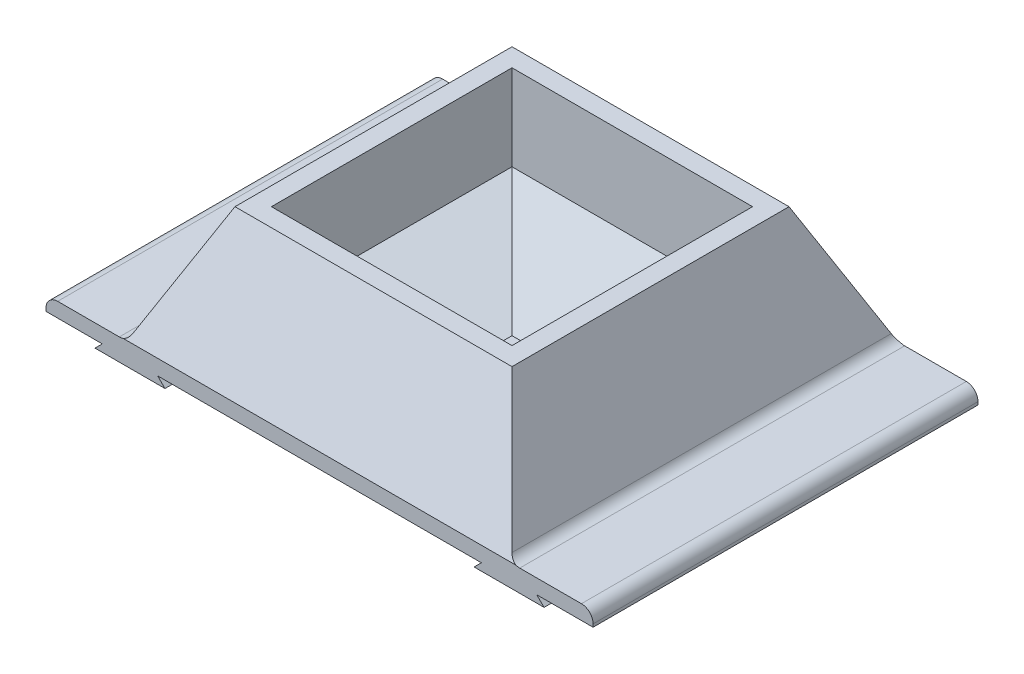
ISO-10303-21;
HEADER;
FILE_DESCRIPTION(('STEP AP214'),'2;1');
FILE_NAME('part.step','',(''),(''),'','','');
FILE_SCHEMA(('AUTOMOTIVE_DESIGN { 1 0 10303 214 1 1 1 1 }'));
ENDSEC;
DATA;
#1=APPLICATION_CONTEXT('core data for automotive mechanical design processes');
#2=APPLICATION_PROTOCOL_DEFINITION('international standard','automotive_design',2000,#1);
#3=PRODUCT_CONTEXT('',#1,'mechanical');
#4=PRODUCT('Part','Part','',(#3));
#5=PRODUCT_RELATED_PRODUCT_CATEGORY('part','',(#4));
#6=PRODUCT_DEFINITION_FORMATION('','',#4);
#7=PRODUCT_DEFINITION_CONTEXT('part definition',#1,'design');
#8=PRODUCT_DEFINITION('design','',#6,#7);
#9=PRODUCT_DEFINITION_SHAPE('','',#8);
#10=(LENGTH_UNIT() NAMED_UNIT(*) SI_UNIT(.MILLI.,.METRE.));
#11=(NAMED_UNIT(*) PLANE_ANGLE_UNIT() SI_UNIT($,.RADIAN.));
#12=(NAMED_UNIT(*) SI_UNIT($,.STERADIAN.) SOLID_ANGLE_UNIT());
#13=UNCERTAINTY_MEASURE_WITH_UNIT(LENGTH_MEASURE(1.E-05),#10,'distance_accuracy_value','');
#14=(GEOMETRIC_REPRESENTATION_CONTEXT(3) GLOBAL_UNCERTAINTY_ASSIGNED_CONTEXT((#13)) GLOBAL_UNIT_ASSIGNED_CONTEXT((#10,
#11,#12)) REPRESENTATION_CONTEXT('',''));
#15=CARTESIAN_POINT('',(0.,0.,0.));
#16=DIRECTION('',(0.,0.,1.));
#17=DIRECTION('',(1.,0.,0.));
#18=AXIS2_PLACEMENT_3D('',#15,#16,#17);
#19=CARTESIAN_POINT('',(0.,0.,0.));
#20=DIRECTION('',(0.,-1.,0.));
#21=DIRECTION('',(0.,0.,-1.));
#22=AXIS2_PLACEMENT_3D('',#19,#20,#21);
#23=PLANE('',#22);
#24=DIRECTION('',(0.,0.,-1.));
#25=VECTOR('',#24,1.);
#26=CARTESIAN_POINT('',(94.615,0.,114.464918420515));
#27=LINE('',#26,#25);
#28=CARTESIAN_POINT('',(94.615,0.,83.82));
#29=VERTEX_POINT('',#28);
#30=CARTESIAN_POINT('',(94.615,0.,-83.82));
#31=VERTEX_POINT('',#30);
#32=EDGE_CURVE('E251',#29,#31,#27,.T.);
#33=ORIENTED_EDGE('',*,*,#32,.T.);
#34=DIRECTION('',(-1.,0.,0.));
#35=VECTOR('',#34,1.);
#36=CARTESIAN_POINT('',(-119.126,0.,-83.82));
#37=LINE('',#36,#35);
#38=CARTESIAN_POINT('',(119.126,0.,-83.82));
#39=VERTEX_POINT('',#38);
#40=EDGE_CURVE('E373',#39,#31,#37,.T.);
#41=ORIENTED_EDGE('',*,*,#40,.F.);
#42=DIRECTION('',(0.,0.,-1.));
#43=VECTOR('',#42,1.);
#44=CARTESIAN_POINT('',(119.126,0.,83.82));
#45=LINE('',#44,#43);
#46=CARTESIAN_POINT('',(119.126,0.,83.82));
#47=VERTEX_POINT('',#46);
#48=EDGE_CURVE('E356',#47,#39,#45,.T.);
#49=ORIENTED_EDGE('',*,*,#48,.F.);
#50=DIRECTION('',(1.,0.,0.));
#51=VECTOR('',#50,1.);
#52=CARTESIAN_POINT('',(-119.126,0.,83.82));
#53=LINE('',#52,#51);
#54=EDGE_CURVE('E382',#29,#47,#53,.T.);
#55=ORIENTED_EDGE('',*,*,#54,.F.);
#56=EDGE_LOOP('',(#33,#41,#49,#55));
#57=FACE_BOUND('',#56,.T.);
#58=ADVANCED_FACE('F47',(#57),#23,.T.);
#59=DIRECTION('',(0.,0.,-1.));
#60=VECTOR('',#59,1.);
#61=CARTESIAN_POINT('',(70.485,0.,114.464918420515));
#62=LINE('',#61,#60);
#63=CARTESIAN_POINT('',(70.485,0.,83.82));
#64=VERTEX_POINT('',#63);
#65=CARTESIAN_POINT('',(70.485,0.,-83.82));
#66=VERTEX_POINT('',#65);
#67=EDGE_CURVE('E261',#64,#66,#62,.T.);
#68=ORIENTED_EDGE('',*,*,#67,.F.);
#69=CARTESIAN_POINT('',(-70.485,0.,83.82));
#70=VERTEX_POINT('',#69);
#71=EDGE_CURVE('E386',#70,#64,#53,.T.);
#72=ORIENTED_EDGE('',*,*,#71,.F.);
#73=DIRECTION('',(0.,0.,-1.));
#74=VECTOR('',#73,1.);
#75=CARTESIAN_POINT('',(-70.485,0.,114.464918420515));
#76=LINE('',#75,#74);
#77=CARTESIAN_POINT('',(-70.485,0.,-83.82));
#78=VERTEX_POINT('',#77);
#79=EDGE_CURVE('E305',#70,#78,#76,.T.);
#80=ORIENTED_EDGE('',*,*,#79,.T.);
#81=EDGE_CURVE('E378',#66,#78,#37,.T.);
#82=ORIENTED_EDGE('',*,*,#81,.F.);
#83=EDGE_LOOP('',(#68,#72,#80,#82));
#84=FACE_BOUND('',#83,.T.);
#85=ADVANCED_FACE('F546',(#84),#23,.T.);
#86=CARTESIAN_POINT('',(0.,6.35,0.));
#87=DIRECTION('',(0.,-1.,0.));
#88=DIRECTION('',(0.,0.,-1.));
#89=AXIS2_PLACEMENT_3D('',#86,#87,#88);
#90=PLANE('',#89);
#91=DIRECTION('',(1.,0.,0.));
#92=VECTOR('',#91,1.);
#93=CARTESIAN_POINT('',(-119.126,6.35,83.82));
#94=LINE('',#93,#92);
#95=CARTESIAN_POINT('',(87.1871556509743,6.35,83.82));
#96=VERTEX_POINT('',#95);
#97=CARTESIAN_POINT('',(114.046,6.35,83.82));
#98=VERTEX_POINT('',#97);
#99=EDGE_CURVE('E368',#96,#98,#94,.T.);
#100=ORIENTED_EDGE('',*,*,#99,.T.);
#101=DIRECTION('',(0.,0.,-1.));
#102=VECTOR('',#101,1.);
#103=CARTESIAN_POINT('',(114.046,6.35,0.));
#104=LINE('',#103,#102);
#105=CARTESIAN_POINT('',(114.046,6.35,-83.82));
#106=VERTEX_POINT('',#105);
#107=EDGE_CURVE('E458',#98,#106,#104,.T.);
#108=ORIENTED_EDGE('',*,*,#107,.T.);
#109=DIRECTION('',(-1.,0.,0.));
#110=VECTOR('',#109,1.);
#111=CARTESIAN_POINT('',(-119.126,6.35,-83.82));
#112=LINE('',#111,#110);
#113=CARTESIAN_POINT('',(87.1871556509743,6.35,-83.82));
#114=VERTEX_POINT('',#113);
#115=EDGE_CURVE('E361',#106,#114,#112,.T.);
#116=ORIENTED_EDGE('',*,*,#115,.T.);
#117=DIRECTION('',(0.,0.,-1.));
#118=VECTOR('',#117,1.);
#119=CARTESIAN_POINT('',(87.1871556509743,6.35,83.82));
#120=LINE('',#119,#118);
#121=EDGE_CURVE('E442',#114,#96,#120,.F.);
#122=ORIENTED_EDGE('',*,*,#121,.T.);
#123=EDGE_LOOP('',(#100,#108,#116,#122));
#124=FACE_BOUND('',#123,.T.);
#125=ADVANCED_FACE('F526',(#124),#90,.F.);
#126=CARTESIAN_POINT('',(-87.1871556509743,6.35,-83.82));
#127=VERTEX_POINT('',#126);
#128=CARTESIAN_POINT('',(-114.046,6.35,-83.82));
#129=VERTEX_POINT('',#128);
#130=EDGE_CURVE('E357',#127,#129,#112,.T.);
#131=ORIENTED_EDGE('',*,*,#130,.T.);
#132=DIRECTION('',(0.,0.,1.));
#133=VECTOR('',#132,1.);
#134=CARTESIAN_POINT('',(-114.046,6.35,0.));
#135=LINE('',#134,#133);
#136=CARTESIAN_POINT('',(-114.046,6.35,83.82));
#137=VERTEX_POINT('',#136);
#138=EDGE_CURVE('E481',#129,#137,#135,.T.);
#139=ORIENTED_EDGE('',*,*,#138,.T.);
#140=CARTESIAN_POINT('',(-87.1871556509743,6.35,83.82));
#141=VERTEX_POINT('',#140);
#142=EDGE_CURVE('E363',#137,#141,#94,.T.);
#143=ORIENTED_EDGE('',*,*,#142,.T.);
#144=DIRECTION('',(0.,0.,1.));
#145=VECTOR('',#144,1.);
#146=CARTESIAN_POINT('',(-87.1871556509743,6.35,-83.82));
#147=LINE('',#146,#145);
#148=EDGE_CURVE('E477',#141,#127,#147,.F.);
#149=ORIENTED_EDGE('',*,*,#148,.T.);
#150=EDGE_LOOP('',(#131,#139,#143,#149));
#151=FACE_BOUND('',#150,.T.);
#152=ADVANCED_FACE('F568',(#151),#90,.F.);
#153=CARTESIAN_POINT('',(119.126,6.35,83.82));
#154=DIRECTION('',(-1.,0.,0.));
#155=DIRECTION('',(0.,0.,1.));
#156=AXIS2_PLACEMENT_3D('',#153,#154,#155);
#157=PLANE('',#156);
#158=DIRECTION('',(0.,-1.,0.));
#159=VECTOR('',#158,1.);
#160=CARTESIAN_POINT('',(119.126,6.35,-83.82));
#161=LINE('',#160,#159);
#162=CARTESIAN_POINT('',(119.126,1.27,-83.82));
#163=VERTEX_POINT('',#162);
#164=EDGE_CURVE('E395',#163,#39,#161,.T.);
#165=ORIENTED_EDGE('',*,*,#164,.F.);
#166=DIRECTION('',(0.,0.,-1.));
#167=VECTOR('',#166,1.);
#168=CARTESIAN_POINT('',(119.126,1.27,83.82));
#169=LINE('',#168,#167);
#170=CARTESIAN_POINT('',(119.126,1.27,83.82));
#171=VERTEX_POINT('',#170);
#172=EDGE_CURVE('E468',#163,#171,#169,.F.);
#173=ORIENTED_EDGE('',*,*,#172,.T.);
#174=DIRECTION('',(0.,-1.,0.));
#175=VECTOR('',#174,1.);
#176=CARTESIAN_POINT('',(119.126,6.35,83.82));
#177=LINE('',#176,#175);
#178=EDGE_CURVE('E367',#171,#47,#177,.T.);
#179=ORIENTED_EDGE('',*,*,#178,.T.);
#180=ORIENTED_EDGE('',*,*,#48,.T.);
#181=EDGE_LOOP('',(#165,#173,#179,#180));
#182=FACE_BOUND('',#181,.T.);
#183=ADVANCED_FACE('F538',(#182),#157,.F.);
#184=CARTESIAN_POINT('',(-119.126,6.35,-83.82));
#185=DIRECTION('',(0.,0.,1.));
#186=DIRECTION('',(1.,0.,0.));
#187=AXIS2_PLACEMENT_3D('',#184,#185,#186);
#188=PLANE('',#187);
#189=ORIENTED_EDGE('',*,*,#115,.F.);
#190=CARTESIAN_POINT('',(114.046,1.27,-83.82));
#191=DIRECTION('',(0.,0.,1.));
#192=DIRECTION('',(1.,0.,0.));
#193=AXIS2_PLACEMENT_3D('',#190,#191,#192);
#194=CIRCLE('',#193,5.08);
#195=EDGE_CURVE('E465',#106,#163,#194,.F.);
#196=ORIENTED_EDGE('',*,*,#195,.T.);
#197=ORIENTED_EDGE('',*,*,#164,.T.);
#198=ORIENTED_EDGE('',*,*,#40,.T.);
#199=DIRECTION('',(0.707106781186546,-0.707106781186549,0.));
#200=VECTOR('',#199,1.);
#201=CARTESIAN_POINT('',(94.615,0.,-83.82));
#202=LINE('',#201,#200);
#203=CARTESIAN_POINT('',(97.79,-3.175,-83.82));
#204=VERTEX_POINT('',#203);
#205=EDGE_CURVE('E265',#31,#204,#202,.T.);
#206=ORIENTED_EDGE('',*,*,#205,.T.);
#207=DIRECTION('',(-1.,0.,0.));
#208=VECTOR('',#207,1.);
#209=CARTESIAN_POINT('',(97.79,-3.175,-83.82));
#210=LINE('',#209,#208);
#211=CARTESIAN_POINT('',(67.31,-3.175,-83.82));
#212=VERTEX_POINT('',#211);
#213=EDGE_CURVE('E256',#204,#212,#210,.T.);
#214=ORIENTED_EDGE('',*,*,#213,.T.);
#215=DIRECTION('',(0.707106781186547,0.707106781186548,0.));
#216=VECTOR('',#215,1.);
#217=CARTESIAN_POINT('',(67.31,-3.175,-83.82));
#218=LINE('',#217,#216);
#219=EDGE_CURVE('E268',#212,#66,#218,.T.);
#220=ORIENTED_EDGE('',*,*,#219,.T.);
#221=ORIENTED_EDGE('',*,*,#81,.T.);
#222=DIRECTION('',(0.707106781186547,-0.707106781186548,0.));
#223=VECTOR('',#222,1.);
#224=CARTESIAN_POINT('',(-67.31,-3.175,-83.82));
#225=LINE('',#224,#223);
#226=CARTESIAN_POINT('',(-67.31,-3.175,-83.82));
#227=VERTEX_POINT('',#226);
#228=EDGE_CURVE('E291',#78,#227,#225,.T.);
#229=ORIENTED_EDGE('',*,*,#228,.T.);
#230=DIRECTION('',(-1.,0.,0.));
#231=VECTOR('',#230,1.);
#232=CARTESIAN_POINT('',(-97.79,-3.175,-83.82));
#233=LINE('',#232,#231);
#234=CARTESIAN_POINT('',(-97.79,-3.175,-83.82));
#235=VERTEX_POINT('',#234);
#236=EDGE_CURVE('E295',#227,#235,#233,.T.);
#237=ORIENTED_EDGE('',*,*,#236,.T.);
#238=DIRECTION('',(0.707106781186546,0.707106781186549,0.));
#239=VECTOR('',#238,1.);
#240=CARTESIAN_POINT('',(-94.615,0.,-83.82));
#241=LINE('',#240,#239);
#242=CARTESIAN_POINT('',(-94.615,0.,-83.82));
#243=VERTEX_POINT('',#242);
#244=EDGE_CURVE('E274',#235,#243,#241,.T.);
#245=ORIENTED_EDGE('',*,*,#244,.T.);
#246=CARTESIAN_POINT('',(-119.126,0.,-83.82));
#247=VERTEX_POINT('',#246);
#248=EDGE_CURVE('E372',#243,#247,#37,.T.);
#249=ORIENTED_EDGE('',*,*,#248,.T.);
#250=DIRECTION('',(0.,-1.,0.));
#251=VECTOR('',#250,1.);
#252=CARTESIAN_POINT('',(-119.126,6.35,-83.82));
#253=LINE('',#252,#251);
#254=CARTESIAN_POINT('',(-119.126,1.27,-83.82));
#255=VERTEX_POINT('',#254);
#256=EDGE_CURVE('E392',#255,#247,#253,.T.);
#257=ORIENTED_EDGE('',*,*,#256,.F.);
#258=CARTESIAN_POINT('',(-114.046,1.27,-83.82));
#259=DIRECTION('',(0.,0.,1.));
#260=DIRECTION('',(1.,0.,0.));
#261=AXIS2_PLACEMENT_3D('',#258,#259,#260);
#262=CIRCLE('',#261,5.08);
#263=EDGE_CURVE('E462',#255,#129,#262,.F.);
#264=ORIENTED_EDGE('',*,*,#263,.T.);
#265=ORIENTED_EDGE('',*,*,#130,.F.);
#266=CARTESIAN_POINT('',(-87.1871556509743,11.43,-83.82));
#267=DIRECTION('',(0.,0.,1.));
#268=DIRECTION('',(1.,0.,0.));
#269=AXIS2_PLACEMENT_3D('',#266,#267,#268);
#270=CIRCLE('',#269,5.08);
#271=CARTESIAN_POINT('',(-85.5439003069082,6.62311827957063,-83.82));
#272=VERTEX_POINT('',#271);
#273=EDGE_CURVE('E494',#127,#272,#270,.T.);
#274=ORIENTED_EDGE('',*,*,#273,.T.);
#275=DIRECTION('',(-1.,0.,0.));
#276=VECTOR('',#275,1.);
#277=CARTESIAN_POINT('',(-119.126,6.62311827957061,-83.82));
#278=LINE('',#277,#276);
#279=CARTESIAN_POINT('',(85.5439003069079,6.62311827957071,-83.82));
#280=VERTEX_POINT('',#279);
#281=EDGE_CURVE('E62',#272,#280,#278,.F.);
#282=ORIENTED_EDGE('',*,*,#281,.T.);
#283=CARTESIAN_POINT('',(87.1871556509743,11.43,-83.82));
#284=DIRECTION('',(0.,0.,1.));
#285=DIRECTION('',(1.,0.,0.));
#286=AXIS2_PLACEMENT_3D('',#283,#284,#285);
#287=CIRCLE('',#286,5.08);
#288=EDGE_CURVE('E11',#280,#114,#287,.T.);
#289=ORIENTED_EDGE('',*,*,#288,.T.);
#290=EDGE_LOOP('',(#189,#196,#197,#198,#206,#214,#220,#221,#229,#237,#245,#249,#257,#264,#265,
#274,#282,#289));
#291=FACE_BOUND('',#290,.T.);
#292=ADVANCED_FACE('F523',(#291),#188,.F.);
#293=CARTESIAN_POINT('',(-119.126,6.35,83.82));
#294=DIRECTION('',(1.,0.,0.));
#295=DIRECTION('',(0.,0.,-1.));
#296=AXIS2_PLACEMENT_3D('',#293,#294,#295);
#297=PLANE('',#296);
#298=DIRECTION('',(0.,-1.,0.));
#299=VECTOR('',#298,1.);
#300=CARTESIAN_POINT('',(-119.126,6.35,83.82));
#301=LINE('',#300,#299);
#302=CARTESIAN_POINT('',(-119.126,1.27,83.82));
#303=VERTEX_POINT('',#302);
#304=CARTESIAN_POINT('',(-119.126,0.,83.82));
#305=VERTEX_POINT('',#304);
#306=EDGE_CURVE('E389',#303,#305,#301,.T.);
#307=ORIENTED_EDGE('',*,*,#306,.F.);
#308=DIRECTION('',(0.,0.,1.));
#309=VECTOR('',#308,1.);
#310=CARTESIAN_POINT('',(-119.126,1.27,83.82));
#311=LINE('',#310,#309);
#312=EDGE_CURVE('E485',#303,#255,#311,.F.);
#313=ORIENTED_EDGE('',*,*,#312,.T.);
#314=ORIENTED_EDGE('',*,*,#256,.T.);
#315=DIRECTION('',(0.,0.,1.));
#316=VECTOR('',#315,1.);
#317=CARTESIAN_POINT('',(-119.126,0.,83.82));
#318=LINE('',#317,#316);
#319=EDGE_CURVE('E377',#247,#305,#318,.T.);
#320=ORIENTED_EDGE('',*,*,#319,.T.);
#321=EDGE_LOOP('',(#307,#313,#314,#320));
#322=FACE_BOUND('',#321,.T.);
#323=ADVANCED_FACE('F561',(#322),#297,.F.);
#324=CARTESIAN_POINT('',(-119.126,6.35,83.82));
#325=DIRECTION('',(0.,0.,-1.));
#326=DIRECTION('',(-1.,0.,0.));
#327=AXIS2_PLACEMENT_3D('',#324,#325,#326);
#328=PLANE('',#327);
#329=ORIENTED_EDGE('',*,*,#178,.F.);
#330=CARTESIAN_POINT('',(114.046,1.27,83.82));
#331=DIRECTION('',(0.,0.,-1.));
#332=DIRECTION('',(-1.,0.,0.));
#333=AXIS2_PLACEMENT_3D('',#330,#331,#332);
#334=CIRCLE('',#333,5.08);
#335=EDGE_CURVE('E474',#171,#98,#334,.F.);
#336=ORIENTED_EDGE('',*,*,#335,.T.);
#337=ORIENTED_EDGE('',*,*,#99,.F.);
#338=CARTESIAN_POINT('',(87.1871556509743,11.43,83.82));
#339=DIRECTION('',(0.,0.,-1.));
#340=DIRECTION('',(-1.,0.,0.));
#341=AXIS2_PLACEMENT_3D('',#338,#339,#340);
#342=CIRCLE('',#341,5.08);
#343=CARTESIAN_POINT('',(85.5439003069082,6.62311827957063,83.82));
#344=VERTEX_POINT('',#343);
#345=EDGE_CURVE('E506',#96,#344,#342,.T.);
#346=ORIENTED_EDGE('',*,*,#345,.T.);
#347=DIRECTION('',(1.,0.,0.));
#348=VECTOR('',#347,1.);
#349=CARTESIAN_POINT('',(-119.126,6.62311827957073,83.82));
#350=LINE('',#349,#348);
#351=CARTESIAN_POINT('',(-85.5439003069079,6.62311827957072,83.82));
#352=VERTEX_POINT('',#351);
#353=EDGE_CURVE('E70',#344,#352,#350,.F.);
#354=ORIENTED_EDGE('',*,*,#353,.T.);
#355=CARTESIAN_POINT('',(-87.1871556509743,11.43,83.82));
#356=DIRECTION('',(0.,0.,-1.));
#357=DIRECTION('',(-1.,0.,0.));
#358=AXIS2_PLACEMENT_3D('',#355,#356,#357);
#359=CIRCLE('',#358,5.08);
#360=EDGE_CURVE('E503',#352,#141,#359,.T.);
#361=ORIENTED_EDGE('',*,*,#360,.T.);
#362=ORIENTED_EDGE('',*,*,#142,.F.);
#363=CARTESIAN_POINT('',(-114.046,1.27,83.82));
#364=DIRECTION('',(0.,0.,-1.));
#365=DIRECTION('',(-1.,0.,0.));
#366=AXIS2_PLACEMENT_3D('',#363,#364,#365);
#367=CIRCLE('',#366,5.08);
#368=EDGE_CURVE('E471',#137,#303,#367,.F.);
#369=ORIENTED_EDGE('',*,*,#368,.T.);
#370=ORIENTED_EDGE('',*,*,#306,.T.);
#371=CARTESIAN_POINT('',(-94.615,0.,83.82));
#372=VERTEX_POINT('',#371);
#373=EDGE_CURVE('E362',#305,#372,#53,.T.);
#374=ORIENTED_EDGE('',*,*,#373,.T.);
#375=DIRECTION('',(-0.707106781186546,-0.707106781186549,0.));
#376=VECTOR('',#375,1.);
#377=CARTESIAN_POINT('',(-94.615,0.,83.82));
#378=LINE('',#377,#376);
#379=CARTESIAN_POINT('',(-97.79,-3.175,83.82));
#380=VERTEX_POINT('',#379);
#381=EDGE_CURVE('E284',#372,#380,#378,.T.);
#382=ORIENTED_EDGE('',*,*,#381,.T.);
#383=DIRECTION('',(1.,0.,0.));
#384=VECTOR('',#383,1.);
#385=CARTESIAN_POINT('',(-97.79,-3.175,83.82));
#386=LINE('',#385,#384);
#387=CARTESIAN_POINT('',(-67.31,-3.175,83.82));
#388=VERTEX_POINT('',#387);
#389=EDGE_CURVE('E280',#380,#388,#386,.T.);
#390=ORIENTED_EDGE('',*,*,#389,.T.);
#391=DIRECTION('',(-0.707106781186547,0.707106781186548,0.));
#392=VECTOR('',#391,1.);
#393=CARTESIAN_POINT('',(-67.31,-3.175,83.82));
#394=LINE('',#393,#392);
#395=EDGE_CURVE('E276',#388,#70,#394,.T.);
#396=ORIENTED_EDGE('',*,*,#395,.T.);
#397=ORIENTED_EDGE('',*,*,#71,.T.);
#398=DIRECTION('',(-0.707106781186547,-0.707106781186548,0.));
#399=VECTOR('',#398,1.);
#400=CARTESIAN_POINT('',(67.31,-3.175,83.82));
#401=LINE('',#400,#399);
#402=CARTESIAN_POINT('',(67.31,-3.175,83.82));
#403=VERTEX_POINT('',#402);
#404=EDGE_CURVE('E240',#64,#403,#401,.T.);
#405=ORIENTED_EDGE('',*,*,#404,.T.);
#406=DIRECTION('',(1.,0.,0.));
#407=VECTOR('',#406,1.);
#408=CARTESIAN_POINT('',(97.79,-3.175,83.82));
#409=LINE('',#408,#407);
#410=CARTESIAN_POINT('',(97.79,-3.175,83.82));
#411=VERTEX_POINT('',#410);
#412=EDGE_CURVE('E232',#403,#411,#409,.T.);
#413=ORIENTED_EDGE('',*,*,#412,.T.);
#414=DIRECTION('',(-0.707106781186546,0.707106781186549,0.));
#415=VECTOR('',#414,1.);
#416=CARTESIAN_POINT('',(94.615,0.,83.82));
#417=LINE('',#416,#415);
#418=EDGE_CURVE('E237',#411,#29,#417,.T.);
#419=ORIENTED_EDGE('',*,*,#418,.T.);
#420=ORIENTED_EDGE('',*,*,#54,.T.);
#421=EDGE_LOOP('',(#329,#336,#337,#346,#354,#361,#362,#369,#370,#374,#382,#390,#396,#397,#405,
#413,#419,#420));
#422=FACE_BOUND('',#421,.T.);
#423=ADVANCED_FACE('F235',(#422),#328,.F.);
#424=DIRECTION('',(0.,0.,-1.));
#425=VECTOR('',#424,1.);
#426=CARTESIAN_POINT('',(-94.615,0.,114.464918420515));
#427=LINE('',#426,#425);
#428=EDGE_CURVE('E299',#372,#243,#427,.T.);
#429=ORIENTED_EDGE('',*,*,#428,.F.);
#430=ORIENTED_EDGE('',*,*,#373,.F.);
#431=ORIENTED_EDGE('',*,*,#319,.F.);
#432=ORIENTED_EDGE('',*,*,#248,.F.);
#433=EDGE_LOOP('',(#429,#430,#431,#432));
#434=FACE_BOUND('',#433,.T.);
#435=ADVANCED_FACE('F558',(#434),#23,.T.);
#436=CARTESIAN_POINT('',(0.,57.15,0.));
#437=DIRECTION('',(0.,1.,0.));
#438=DIRECTION('',(0.,0.,1.));
#439=AXIS2_PLACEMENT_3D('',#436,#437,#438);
#440=PLANE('',#439);
#441=DIRECTION('',(0.,0.,1.));
#442=VECTOR('',#441,1.);
#443=CARTESIAN_POINT('',(-60.325,57.15,60.325));
#444=LINE('',#443,#442);
#445=CARTESIAN_POINT('',(-60.325,57.15,-60.325));
#446=VERTEX_POINT('',#445);
#447=CARTESIAN_POINT('',(-60.325,57.15,60.325));
#448=VERTEX_POINT('',#447);
#449=EDGE_CURVE('E342',#446,#448,#444,.T.);
#450=ORIENTED_EDGE('',*,*,#449,.T.);
#451=DIRECTION('',(1.,0.,0.));
#452=VECTOR('',#451,1.);
#453=CARTESIAN_POINT('',(60.325,57.15,60.325));
#454=LINE('',#453,#452);
#455=CARTESIAN_POINT('',(60.325,57.15,60.325));
#456=VERTEX_POINT('',#455);
#457=EDGE_CURVE('E345',#448,#456,#454,.T.);
#458=ORIENTED_EDGE('',*,*,#457,.T.);
#459=DIRECTION('',(0.,0.,-1.));
#460=VECTOR('',#459,1.);
#461=CARTESIAN_POINT('',(60.325,57.15,60.325));
#462=LINE('',#461,#460);
#463=CARTESIAN_POINT('',(60.325,57.15,-60.325));
#464=VERTEX_POINT('',#463);
#465=EDGE_CURVE('E349',#456,#464,#462,.T.);
#466=ORIENTED_EDGE('',*,*,#465,.T.);
#467=DIRECTION('',(-1.,0.,0.));
#468=VECTOR('',#467,1.);
#469=CARTESIAN_POINT('',(60.325,57.15,-60.325));
#470=LINE('',#469,#468);
#471=EDGE_CURVE('E353',#464,#446,#470,.T.);
#472=ORIENTED_EDGE('',*,*,#471,.T.);
#473=EDGE_LOOP('',(#450,#458,#466,#472));
#474=FACE_BOUND('',#473,.T.);
#475=DIRECTION('',(-1.,0.,0.));
#476=VECTOR('',#475,1.);
#477=CARTESIAN_POINT('',(-52.3875,57.15,-52.3875));
#478=LINE('',#477,#476);
#479=CARTESIAN_POINT('',(52.3875,57.15,-52.3875));
#480=VERTEX_POINT('',#479);
#481=CARTESIAN_POINT('',(-52.3875,57.15,-52.3875));
#482=VERTEX_POINT('',#481);
#483=EDGE_CURVE('E315',#480,#482,#478,.T.);
#484=ORIENTED_EDGE('',*,*,#483,.F.);
#485=DIRECTION('',(0.,0.,-1.));
#486=VECTOR('',#485,1.);
#487=CARTESIAN_POINT('',(52.3875,57.15,52.3875));
#488=LINE('',#487,#486);
#489=CARTESIAN_POINT('',(52.3875,57.15,52.3875));
#490=VERTEX_POINT('',#489);
#491=EDGE_CURVE('E312',#490,#480,#488,.T.);
#492=ORIENTED_EDGE('',*,*,#491,.F.);
#493=DIRECTION('',(1.,0.,0.));
#494=VECTOR('',#493,1.);
#495=CARTESIAN_POINT('',(-52.3875,57.15,52.3875));
#496=LINE('',#495,#494);
#497=CARTESIAN_POINT('',(-52.3875,57.15,52.3875));
#498=VERTEX_POINT('',#497);
#499=EDGE_CURVE('E323',#498,#490,#496,.T.);
#500=ORIENTED_EDGE('',*,*,#499,.F.);
#501=DIRECTION('',(0.,0.,1.));
#502=VECTOR('',#501,1.);
#503=CARTESIAN_POINT('',(-52.3875,57.15,52.3875));
#504=LINE('',#503,#502);
#505=EDGE_CURVE('E319',#482,#498,#504,.T.);
#506=ORIENTED_EDGE('',*,*,#505,.F.);
#507=EDGE_LOOP('',(#484,#492,#500,#506));
#508=FACE_BOUND('',#507,.T.);
#509=ADVANCED_FACE('F584',(#474,#508),#440,.T.);
#510=CARTESIAN_POINT('',(52.3875,57.15,52.3875));
#511=DIRECTION('',(-1.,0.,0.));
#512=DIRECTION('',(0.,0.,1.));
#513=AXIS2_PLACEMENT_3D('',#510,#511,#512);
#514=PLANE('',#513);
#515=DIRECTION('',(0.,-1.,0.));
#516=VECTOR('',#515,1.);
#517=CARTESIAN_POINT('',(52.3875,57.15,-52.3875));
#518=LINE('',#517,#516);
#519=CARTESIAN_POINT('',(52.3875,19.812,-52.3875));
#520=VERTEX_POINT('',#519);
#521=EDGE_CURVE('E338',#480,#520,#518,.T.);
#522=ORIENTED_EDGE('',*,*,#521,.T.);
#523=DIRECTION('',(0.,0.,1.));
#524=VECTOR('',#523,1.);
#525=CARTESIAN_POINT('',(52.3875,19.812,52.3875));
#526=LINE('',#525,#524);
#527=CARTESIAN_POINT('',(52.3875,19.812,52.3875));
#528=VERTEX_POINT('',#527);
#529=EDGE_CURVE('E433',#520,#528,#526,.T.);
#530=ORIENTED_EDGE('',*,*,#529,.T.);
#531=DIRECTION('',(0.,-1.,0.));
#532=VECTOR('',#531,1.);
#533=CARTESIAN_POINT('',(52.3875,57.15,52.3875));
#534=LINE('',#533,#532);
#535=EDGE_CURVE('E326',#490,#528,#534,.T.);
#536=ORIENTED_EDGE('',*,*,#535,.F.);
#537=ORIENTED_EDGE('',*,*,#491,.T.);
#538=EDGE_LOOP('',(#522,#530,#536,#537));
#539=FACE_BOUND('',#538,.T.);
#540=ADVANCED_FACE('F619',(#539),#514,.T.);
#541=CARTESIAN_POINT('',(-52.3875,57.15,-52.3875));
#542=DIRECTION('',(0.,0.,1.));
#543=DIRECTION('',(1.,0.,0.));
#544=AXIS2_PLACEMENT_3D('',#541,#542,#543);
#545=PLANE('',#544);
#546=DIRECTION('',(0.,-1.,0.));
#547=VECTOR('',#546,1.);
#548=CARTESIAN_POINT('',(-52.3875,57.15,-52.3875));
#549=LINE('',#548,#547);
#550=CARTESIAN_POINT('',(-52.3875,19.812,-52.3875));
#551=VERTEX_POINT('',#550);
#552=EDGE_CURVE('E334',#482,#551,#549,.T.);
#553=ORIENTED_EDGE('',*,*,#552,.T.);
#554=DIRECTION('',(1.,0.,0.));
#555=VECTOR('',#554,1.);
#556=CARTESIAN_POINT('',(-52.3875,19.812,-52.3875));
#557=LINE('',#556,#555);
#558=EDGE_CURVE('E429',#551,#520,#557,.T.);
#559=ORIENTED_EDGE('',*,*,#558,.T.);
#560=ORIENTED_EDGE('',*,*,#521,.F.);
#561=ORIENTED_EDGE('',*,*,#483,.T.);
#562=EDGE_LOOP('',(#553,#559,#560,#561));
#563=FACE_BOUND('',#562,.T.);
#564=ADVANCED_FACE('F674',(#563),#545,.T.);
#565=CARTESIAN_POINT('',(-52.3875,57.15,52.3875));
#566=DIRECTION('',(1.,0.,0.));
#567=DIRECTION('',(0.,0.,-1.));
#568=AXIS2_PLACEMENT_3D('',#565,#566,#567);
#569=PLANE('',#568);
#570=DIRECTION('',(0.,-1.,0.));
#571=VECTOR('',#570,1.);
#572=CARTESIAN_POINT('',(-52.3875,57.15,52.3875));
#573=LINE('',#572,#571);
#574=CARTESIAN_POINT('',(-52.3875,19.812,52.3875));
#575=VERTEX_POINT('',#574);
#576=EDGE_CURVE('E330',#498,#575,#573,.T.);
#577=ORIENTED_EDGE('',*,*,#576,.T.);
#578=DIRECTION('',(0.,0.,-1.));
#579=VECTOR('',#578,1.);
#580=CARTESIAN_POINT('',(-52.3875,19.812,52.3875));
#581=LINE('',#580,#579);
#582=EDGE_CURVE('E436',#575,#551,#581,.T.);
#583=ORIENTED_EDGE('',*,*,#582,.T.);
#584=ORIENTED_EDGE('',*,*,#552,.F.);
#585=ORIENTED_EDGE('',*,*,#505,.T.);
#586=EDGE_LOOP('',(#577,#583,#584,#585));
#587=FACE_BOUND('',#586,.T.);
#588=ADVANCED_FACE('F644',(#587),#569,.T.);
#589=CARTESIAN_POINT('',(-52.3875,57.15,52.3875));
#590=DIRECTION('',(0.,0.,-1.));
#591=DIRECTION('',(-1.,0.,0.));
#592=AXIS2_PLACEMENT_3D('',#589,#590,#591);
#593=PLANE('',#592);
#594=ORIENTED_EDGE('',*,*,#535,.T.);
#595=DIRECTION('',(-1.,0.,0.));
#596=VECTOR('',#595,1.);
#597=CARTESIAN_POINT('',(-52.3875,19.812,52.3875));
#598=LINE('',#597,#596);
#599=EDGE_CURVE('E439',#528,#575,#598,.T.);
#600=ORIENTED_EDGE('',*,*,#599,.T.);
#601=ORIENTED_EDGE('',*,*,#576,.F.);
#602=ORIENTED_EDGE('',*,*,#499,.T.);
#603=EDGE_LOOP('',(#594,#600,#601,#602));
#604=FACE_BOUND('',#603,.T.);
#605=ADVANCED_FACE('F638',(#604),#593,.T.);
#606=DIRECTION('',(0.,0.,-1.));
#607=VECTOR('',#606,1.);
#608=CARTESIAN_POINT('',(2.1466320285066,6.35,0.));
#609=LINE('',#608,#607);
#610=CARTESIAN_POINT('',(2.1466320285066,6.35,2.14663202850658));
#611=VERTEX_POINT('',#610);
#612=CARTESIAN_POINT('',(2.1466320285066,6.35,-2.14663202850659));
#613=VERTEX_POINT('',#612);
#614=EDGE_CURVE('E422',#611,#613,#609,.T.);
#615=ORIENTED_EDGE('',*,*,#614,.T.);
#616=DIRECTION('',(-1.,0.,0.));
#617=VECTOR('',#616,1.);
#618=CARTESIAN_POINT('',(0.,6.35,-2.14663202850659));
#619=LINE('',#618,#617);
#620=CARTESIAN_POINT('',(-2.14663202850657,6.35,-2.14663202850659));
#621=VERTEX_POINT('',#620);
#622=EDGE_CURVE('E425',#613,#621,#619,.T.);
#623=ORIENTED_EDGE('',*,*,#622,.T.);
#624=DIRECTION('',(0.,0.,1.));
#625=VECTOR('',#624,1.);
#626=CARTESIAN_POINT('',(-2.14663202850657,6.35,0.));
#627=LINE('',#626,#625);
#628=CARTESIAN_POINT('',(-2.14663202850657,6.35,2.14663202850658));
#629=VERTEX_POINT('',#628);
#630=EDGE_CURVE('E419',#621,#629,#627,.T.);
#631=ORIENTED_EDGE('',*,*,#630,.T.);
#632=DIRECTION('',(1.,0.,0.));
#633=VECTOR('',#632,1.);
#634=CARTESIAN_POINT('',(0.,6.35,2.14663202850658));
#635=LINE('',#634,#633);
#636=EDGE_CURVE('E402',#629,#611,#635,.T.);
#637=ORIENTED_EDGE('',*,*,#636,.T.);
#638=EDGE_LOOP('',(#615,#623,#631,#637));
#639=FACE_BOUND('',#638,.T.);
#640=ADVANCED_FACE('F633',(#639),#90,.F.);
#641=CARTESIAN_POINT('',(60.325,57.1500000000002,-60.325));
#642=DIRECTION('',(0.,0.421644063169991,-0.906761426172012));
#643=DIRECTION('',(1.,0.,0.));
#644=AXIS2_PLACEMENT_3D('',#641,#642,#643);
#645=PLANE('',#644);
#646=DIRECTION('',(-0.388519854134629,0.83552656803145,0.388519854134629));
#647=VECTOR('',#646,1.);
#648=CARTESIAN_POINT('',(42.1131627630979,96.3152413696817,-42.1131627630979));
#649=LINE('',#648,#647);
#650=CARTESIAN_POINT('',(82.5808076060205,9.28804815909644,-82.5808076060205));
#651=VERTEX_POINT('',#650);
#652=EDGE_CURVE('E411',#651,#464,#649,.T.);
#653=ORIENTED_EDGE('',*,*,#652,.F.);
#654=CARTESIAN_POINT('',(87.1871556509743,11.43,-81.5848000000003));
#655=DIRECTION('',(0.,0.421644063169991,-0.906761426172012));
#656=DIRECTION('',(0.,0.906761426172012,0.421644063169991));
#657=AXIS2_PLACEMENT_3D('',#654,#655,#656);
#658=ELLIPSE('',#657,5.60235565097398,5.08);
#659=EDGE_CURVE('E56',#651,#280,#658,.F.);
#660=ORIENTED_EDGE('',*,*,#659,.T.);
#661=ORIENTED_EDGE('',*,*,#281,.F.);
#662=CARTESIAN_POINT('',(-87.1871556509743,11.43,-81.5848000000003));
#663=DIRECTION('',(0.,0.421644063169991,-0.906761426172012));
#664=DIRECTION('',(0.,-0.906761426172012,-0.421644063169991));
#665=AXIS2_PLACEMENT_3D('',#662,#663,#664);
#666=ELLIPSE('',#665,5.60235565097398,5.08);
#667=CARTESIAN_POINT('',(-82.5808076060205,9.28804815909647,-82.5808076060204));
#668=VERTEX_POINT('',#667);
#669=EDGE_CURVE('E497',#272,#668,#666,.F.);
#670=ORIENTED_EDGE('',*,*,#669,.T.);
#671=DIRECTION('',(-0.388519854134629,-0.83552656803145,-0.388519854134629));
#672=VECTOR('',#671,1.);
#673=CARTESIAN_POINT('',(-42.1131627630979,96.3152413696817,-42.1131627630979));
#674=LINE('',#673,#672);
#675=EDGE_CURVE('E316',#446,#668,#674,.T.);
#676=ORIENTED_EDGE('',*,*,#675,.F.);
#677=ORIENTED_EDGE('',*,*,#471,.F.);
#678=EDGE_LOOP('',(#653,#660,#661,#670,#676,#677));
#679=FACE_BOUND('',#678,.T.);
#680=ADVANCED_FACE('F516',(#679),#645,.T.);
#681=CARTESIAN_POINT('',(-60.325,57.1500000000002,60.325));
#682=DIRECTION('',(-0.906761426172012,0.42164406316999,0.));
#683=DIRECTION('',(0.,0.,-1.));
#684=AXIS2_PLACEMENT_3D('',#681,#682,#683);
#685=PLANE('',#684);
#686=ORIENTED_EDGE('',*,*,#675,.T.);
#687=DIRECTION('',(0.,0.,-1.));
#688=VECTOR('',#687,1.);
#689=CARTESIAN_POINT('',(-82.5808076060205,9.28804815909645,83.82));
#690=LINE('',#689,#688);
#691=CARTESIAN_POINT('',(-82.5808076060205,9.28804815909645,82.5808076060205));
#692=VERTEX_POINT('',#691);
#693=EDGE_CURVE('E488',#668,#692,#690,.F.);
#694=ORIENTED_EDGE('',*,*,#693,.T.);
#695=DIRECTION('',(-0.388519854134629,-0.83552656803145,0.388519854134629));
#696=VECTOR('',#695,1.);
#697=CARTESIAN_POINT('',(-42.1131627630979,96.3152413696817,42.1131627630979));
#698=LINE('',#697,#696);
#699=EDGE_CURVE('E406',#448,#692,#698,.T.);
#700=ORIENTED_EDGE('',*,*,#699,.F.);
#701=ORIENTED_EDGE('',*,*,#449,.F.);
#702=EDGE_LOOP('',(#686,#694,#700,#701));
#703=FACE_BOUND('',#702,.T.);
#704=ADVANCED_FACE('F580',(#703),#685,.T.);
#705=CARTESIAN_POINT('',(60.325,57.1500000000002,60.325));
#706=DIRECTION('',(0.906761426172012,0.421644063169991,0.));
#707=DIRECTION('',(0.,0.,1.));
#708=AXIS2_PLACEMENT_3D('',#705,#706,#707);
#709=PLANE('',#708);
#710=DIRECTION('',(-0.388519854134629,0.83552656803145,-0.388519854134629));
#711=VECTOR('',#710,1.);
#712=CARTESIAN_POINT('',(60.325,57.1500000000002,60.325));
#713=LINE('',#712,#711);
#714=CARTESIAN_POINT('',(82.5808076060205,9.28804815909645,82.5808076060205));
#715=VERTEX_POINT('',#714);
#716=EDGE_CURVE('E403',#715,#456,#713,.T.);
#717=ORIENTED_EDGE('',*,*,#716,.F.);
#718=DIRECTION('',(0.,0.,1.));
#719=VECTOR('',#718,1.);
#720=CARTESIAN_POINT('',(82.5808076060205,9.28804815909645,-83.82));
#721=LINE('',#720,#719);
#722=EDGE_CURVE('E491',#715,#651,#721,.F.);
#723=ORIENTED_EDGE('',*,*,#722,.T.);
#724=ORIENTED_EDGE('',*,*,#652,.T.);
#725=ORIENTED_EDGE('',*,*,#465,.F.);
#726=EDGE_LOOP('',(#717,#723,#724,#725));
#727=FACE_BOUND('',#726,.T.);
#728=ADVANCED_FACE('F589',(#727),#709,.T.);
#729=CARTESIAN_POINT('',(60.325,57.1500000000002,60.325));
#730=DIRECTION('',(0.,0.421644063169991,0.906761426172012));
#731=DIRECTION('',(-1.,0.,0.));
#732=AXIS2_PLACEMENT_3D('',#729,#730,#731);
#733=PLANE('',#732);
#734=ORIENTED_EDGE('',*,*,#699,.T.);
#735=CARTESIAN_POINT('',(-87.1871556509743,11.43,81.5848000000003));
#736=DIRECTION('',(0.,0.421644063169991,0.906761426172012));
#737=DIRECTION('',(0.,0.906761426172012,-0.421644063169991));
#738=AXIS2_PLACEMENT_3D('',#735,#736,#737);
#739=ELLIPSE('',#738,5.60235565097398,5.08);
#740=EDGE_CURVE('E500',#692,#352,#739,.F.);
#741=ORIENTED_EDGE('',*,*,#740,.T.);
#742=ORIENTED_EDGE('',*,*,#353,.F.);
#743=CARTESIAN_POINT('',(87.1871556509743,11.43,81.5848000000003));
#744=DIRECTION('',(0.,0.421644063169991,0.906761426172012));
#745=DIRECTION('',(0.,-0.906761426172012,0.421644063169991));
#746=AXIS2_PLACEMENT_3D('',#743,#744,#745);
#747=ELLIPSE('',#746,5.60235565097398,5.08);
#748=EDGE_CURVE('E509',#344,#715,#747,.F.);
#749=ORIENTED_EDGE('',*,*,#748,.T.);
#750=ORIENTED_EDGE('',*,*,#716,.T.);
#751=ORIENTED_EDGE('',*,*,#457,.F.);
#752=EDGE_LOOP('',(#734,#741,#742,#749,#750,#751));
#753=FACE_BOUND('',#752,.T.);
#754=ADVANCED_FACE('F591',(#753),#733,.T.);
#755=CARTESIAN_POINT('',(0.,6.35,2.14663202850658));
#756=DIRECTION('',(0.,-0.96592582628907,0.258819045102515));
#757=DIRECTION('',(1.,0.,0.));
#758=AXIS2_PLACEMENT_3D('',#755,#756,#757);
#759=PLANE('',#758);
#760=DIRECTION('',(-0.694746590606866,0.186156787897381,0.694746590606866));
#761=VECTOR('',#760,1.);
#762=CARTESIAN_POINT('',(-1.11051108272865,6.07237222931784,1.11051108272866));
#763=LINE('',#762,#761);
#764=EDGE_CURVE('E448',#575,#629,#763,.F.);
#765=ORIENTED_EDGE('',*,*,#764,.F.);
#766=ORIENTED_EDGE('',*,*,#599,.F.);
#767=DIRECTION('',(-0.694746590606866,-0.186156787897381,-0.694746590606866));
#768=VECTOR('',#767,1.);
#769=CARTESIAN_POINT('',(1.11051108272868,6.07237222931784,1.11051108272866));
#770=LINE('',#769,#768);
#771=EDGE_CURVE('E407',#611,#528,#770,.F.);
#772=ORIENTED_EDGE('',*,*,#771,.F.);
#773=ORIENTED_EDGE('',*,*,#636,.F.);
#774=EDGE_LOOP('',(#765,#766,#772,#773));
#775=FACE_BOUND('',#774,.T.);
#776=ADVANCED_FACE('F593',(#775),#759,.F.);
#777=CARTESIAN_POINT('',(2.1466320285066,6.35,0.));
#778=DIRECTION('',(0.258819045102515,-0.96592582628907,0.));
#779=DIRECTION('',(0.,0.,-1.));
#780=AXIS2_PLACEMENT_3D('',#777,#778,#779);
#781=PLANE('',#780);
#782=ORIENTED_EDGE('',*,*,#771,.T.);
#783=ORIENTED_EDGE('',*,*,#529,.F.);
#784=DIRECTION('',(-0.694746590606866,-0.186156787897381,0.694746590606866));
#785=VECTOR('',#784,1.);
#786=CARTESIAN_POINT('',(1.11051108272867,6.07237222931784,-1.11051108272866));
#787=LINE('',#786,#785);
#788=EDGE_CURVE('E445',#613,#520,#787,.F.);
#789=ORIENTED_EDGE('',*,*,#788,.F.);
#790=ORIENTED_EDGE('',*,*,#614,.F.);
#791=EDGE_LOOP('',(#782,#783,#789,#790));
#792=FACE_BOUND('',#791,.T.);
#793=ADVANCED_FACE('F600',(#792),#781,.F.);
#794=CARTESIAN_POINT('',(-2.14663202850657,6.35,0.));
#795=DIRECTION('',(-0.258819045102515,-0.96592582628907,0.));
#796=DIRECTION('',(0.,0.,1.));
#797=AXIS2_PLACEMENT_3D('',#794,#795,#796);
#798=PLANE('',#797);
#799=ORIENTED_EDGE('',*,*,#764,.T.);
#800=ORIENTED_EDGE('',*,*,#630,.F.);
#801=DIRECTION('',(-0.694746590606866,0.186156787897381,-0.694746590606866));
#802=VECTOR('',#801,1.);
#803=CARTESIAN_POINT('',(-1.11051108272865,6.07237222931784,-1.11051108272867));
#804=LINE('',#803,#802);
#805=EDGE_CURVE('E287',#551,#621,#804,.F.);
#806=ORIENTED_EDGE('',*,*,#805,.F.);
#807=ORIENTED_EDGE('',*,*,#582,.F.);
#808=EDGE_LOOP('',(#799,#800,#806,#807));
#809=FACE_BOUND('',#808,.T.);
#810=ADVANCED_FACE('F661',(#809),#798,.F.);
#811=CARTESIAN_POINT('',(0.,6.35,-2.14663202850659));
#812=DIRECTION('',(0.,-0.96592582628907,-0.258819045102515));
#813=DIRECTION('',(-1.,0.,0.));
#814=AXIS2_PLACEMENT_3D('',#811,#812,#813);
#815=PLANE('',#814);
#816=ORIENTED_EDGE('',*,*,#788,.T.);
#817=ORIENTED_EDGE('',*,*,#558,.F.);
#818=ORIENTED_EDGE('',*,*,#805,.T.);
#819=ORIENTED_EDGE('',*,*,#622,.F.);
#820=EDGE_LOOP('',(#816,#817,#818,#819));
#821=FACE_BOUND('',#820,.T.);
#822=ADVANCED_FACE('F656',(#821),#815,.F.);
#823=CARTESIAN_POINT('',(-94.615,0.,114.464918420515));
#824=DIRECTION('',(-0.707106781186549,0.707106781186546,0.));
#825=DIRECTION('',(-0.707106781186546,-0.707106781186549,0.));
#826=AXIS2_PLACEMENT_3D('',#823,#824,#825);
#827=PLANE('',#826);
#828=ORIENTED_EDGE('',*,*,#381,.F.);
#829=ORIENTED_EDGE('',*,*,#428,.T.);
#830=ORIENTED_EDGE('',*,*,#244,.F.);
#831=DIRECTION('',(0.,0.,-1.));
#832=VECTOR('',#831,1.);
#833=CARTESIAN_POINT('',(-97.79,-3.175,114.464918420515));
#834=LINE('',#833,#832);
#835=EDGE_CURVE('E281',#380,#235,#834,.T.);
#836=ORIENTED_EDGE('',*,*,#835,.F.);
#837=EDGE_LOOP('',(#828,#829,#830,#836));
#838=FACE_BOUND('',#837,.T.);
#839=ADVANCED_FACE('F684',(#838),#827,.T.);
#840=CARTESIAN_POINT('',(-97.79,-3.175,114.464918420515));
#841=DIRECTION('',(0.,-1.,0.));
#842=DIRECTION('',(1.,0.,0.));
#843=AXIS2_PLACEMENT_3D('',#840,#841,#842);
#844=PLANE('',#843);
#845=ORIENTED_EDGE('',*,*,#389,.F.);
#846=ORIENTED_EDGE('',*,*,#835,.T.);
#847=ORIENTED_EDGE('',*,*,#236,.F.);
#848=DIRECTION('',(0.,0.,-1.));
#849=VECTOR('',#848,1.);
#850=CARTESIAN_POINT('',(-67.31,-3.175,114.464918420515));
#851=LINE('',#850,#849);
#852=EDGE_CURVE('E302',#388,#227,#851,.T.);
#853=ORIENTED_EDGE('',*,*,#852,.F.);
#854=EDGE_LOOP('',(#845,#846,#847,#853));
#855=FACE_BOUND('',#854,.T.);
#856=ADVANCED_FACE('F686',(#855),#844,.T.);
#857=CARTESIAN_POINT('',(-67.31,-3.175,114.464918420515));
#858=DIRECTION('',(0.707106781186548,0.707106781186547,0.));
#859=DIRECTION('',(-0.707106781186547,0.707106781186548,0.));
#860=AXIS2_PLACEMENT_3D('',#857,#858,#859);
#861=PLANE('',#860);
#862=ORIENTED_EDGE('',*,*,#395,.F.);
#863=ORIENTED_EDGE('',*,*,#852,.T.);
#864=ORIENTED_EDGE('',*,*,#228,.F.);
#865=ORIENTED_EDGE('',*,*,#79,.F.);
#866=EDGE_LOOP('',(#862,#863,#864,#865));
#867=FACE_BOUND('',#866,.T.);
#868=ADVANCED_FACE('F688',(#867),#861,.T.);
#869=CARTESIAN_POINT('',(97.79,-3.175,114.464918420515));
#870=DIRECTION('',(0.,-1.,0.));
#871=DIRECTION('',(1.,0.,0.));
#872=AXIS2_PLACEMENT_3D('',#869,#870,#871);
#873=PLANE('',#872);
#874=ORIENTED_EDGE('',*,*,#412,.F.);
#875=DIRECTION('',(0.,0.,-1.));
#876=VECTOR('',#875,1.);
#877=CARTESIAN_POINT('',(67.31,-3.175,114.464918420515));
#878=LINE('',#877,#876);
#879=EDGE_CURVE('E269',#403,#212,#878,.T.);
#880=ORIENTED_EDGE('',*,*,#879,.T.);
#881=ORIENTED_EDGE('',*,*,#213,.F.);
#882=DIRECTION('',(0.,0.,-1.));
#883=VECTOR('',#882,1.);
#884=CARTESIAN_POINT('',(97.79,-3.175,114.464918420515));
#885=LINE('',#884,#883);
#886=EDGE_CURVE('E248',#411,#204,#885,.T.);
#887=ORIENTED_EDGE('',*,*,#886,.F.);
#888=EDGE_LOOP('',(#874,#880,#881,#887));
#889=FACE_BOUND('',#888,.T.);
#890=ADVANCED_FACE('F254',(#889),#873,.T.);
#891=CARTESIAN_POINT('',(94.615,0.,114.464918420515));
#892=DIRECTION('',(0.707106781186549,0.707106781186546,0.));
#893=DIRECTION('',(-0.707106781186546,0.707106781186549,0.));
#894=AXIS2_PLACEMENT_3D('',#891,#892,#893);
#895=PLANE('',#894);
#896=ORIENTED_EDGE('',*,*,#418,.F.);
#897=ORIENTED_EDGE('',*,*,#886,.T.);
#898=ORIENTED_EDGE('',*,*,#205,.F.);
#899=ORIENTED_EDGE('',*,*,#32,.F.);
#900=EDGE_LOOP('',(#896,#897,#898,#899));
#901=FACE_BOUND('',#900,.T.);
#902=ADVANCED_FACE('F247',(#901),#895,.T.);
#903=CARTESIAN_POINT('',(67.31,-3.175,114.464918420515));
#904=DIRECTION('',(-0.707106781186548,0.707106781186547,0.));
#905=DIRECTION('',(-0.707106781186547,-0.707106781186548,0.));
#906=AXIS2_PLACEMENT_3D('',#903,#904,#905);
#907=PLANE('',#906);
#908=ORIENTED_EDGE('',*,*,#404,.F.);
#909=ORIENTED_EDGE('',*,*,#67,.T.);
#910=ORIENTED_EDGE('',*,*,#219,.F.);
#911=ORIENTED_EDGE('',*,*,#879,.F.);
#912=EDGE_LOOP('',(#908,#909,#910,#911));
#913=FACE_BOUND('',#912,.T.);
#914=ADVANCED_FACE('F697',(#913),#907,.T.);
#915=CARTESIAN_POINT('',(114.046,1.27,0.));
#916=DIRECTION('',(0.,0.,-1.));
#917=DIRECTION('',(-1.,0.,0.));
#918=AXIS2_PLACEMENT_3D('',#915,#916,#917);
#919=CYLINDRICAL_SURFACE('',#918,5.08);
#920=ORIENTED_EDGE('',*,*,#335,.F.);
#921=ORIENTED_EDGE('',*,*,#172,.F.);
#922=ORIENTED_EDGE('',*,*,#195,.F.);
#923=ORIENTED_EDGE('',*,*,#107,.F.);
#924=EDGE_LOOP('',(#920,#921,#922,#923));
#925=FACE_BOUND('',#924,.T.);
#926=ADVANCED_FACE('F533',(#925),#919,.T.);
#927=CARTESIAN_POINT('',(-114.046,1.27,0.));
#928=DIRECTION('',(0.,0.,1.));
#929=DIRECTION('',(1.,0.,0.));
#930=AXIS2_PLACEMENT_3D('',#927,#928,#929);
#931=CYLINDRICAL_SURFACE('',#930,5.08);
#932=ORIENTED_EDGE('',*,*,#263,.F.);
#933=ORIENTED_EDGE('',*,*,#312,.F.);
#934=ORIENTED_EDGE('',*,*,#368,.F.);
#935=ORIENTED_EDGE('',*,*,#138,.F.);
#936=EDGE_LOOP('',(#932,#933,#934,#935));
#937=FACE_BOUND('',#936,.T.);
#938=ADVANCED_FACE('F564',(#937),#931,.T.);
#939=CARTESIAN_POINT('',(-87.1871556509743,11.43,0.));
#940=DIRECTION('',(0.,0.,-1.));
#941=DIRECTION('',(-1.,0.,0.));
#942=AXIS2_PLACEMENT_3D('',#939,#940,#941);
#943=CYLINDRICAL_SURFACE('',#942,5.08);
#944=ORIENTED_EDGE('',*,*,#740,.F.);
#945=ORIENTED_EDGE('',*,*,#693,.F.);
#946=ORIENTED_EDGE('',*,*,#669,.F.);
#947=ORIENTED_EDGE('',*,*,#273,.F.);
#948=ORIENTED_EDGE('',*,*,#148,.F.);
#949=ORIENTED_EDGE('',*,*,#360,.F.);
#950=EDGE_LOOP('',(#944,#945,#946,#947,#948,#949));
#951=FACE_BOUND('',#950,.T.);
#952=ADVANCED_FACE('F574',(#951),#943,.F.);
#953=CARTESIAN_POINT('',(87.1871556509743,11.43,0.));
#954=DIRECTION('',(0.,0.,1.));
#955=DIRECTION('',(1.,0.,0.));
#956=AXIS2_PLACEMENT_3D('',#953,#954,#955);
#957=CYLINDRICAL_SURFACE('',#956,5.08);
#958=ORIENTED_EDGE('',*,*,#659,.F.);
#959=ORIENTED_EDGE('',*,*,#722,.F.);
#960=ORIENTED_EDGE('',*,*,#748,.F.);
#961=ORIENTED_EDGE('',*,*,#345,.F.);
#962=ORIENTED_EDGE('',*,*,#121,.F.);
#963=ORIENTED_EDGE('',*,*,#288,.F.);
#964=EDGE_LOOP('',(#958,#959,#960,#961,#962,#963));
#965=FACE_BOUND('',#964,.T.);
#966=ADVANCED_FACE('F49',(#965),#957,.F.);
#967=CLOSED_SHELL('',(#58,#85,#125,#152,#183,#292,#323,#423,#435,#509,#540,#564,#588,#605,#640,
#680,#704,#728,#754,#776,#793,#810,#822,#839,#856,#868,#890,#902,#914,#926,#938,#952,#966));
#968=MANIFOLD_SOLID_BREP('B2',#967);
#969=ADVANCED_BREP_SHAPE_REPRESENTATION('',(#18,#968),#14);
#970=SHAPE_DEFINITION_REPRESENTATION(#9,#969);
ENDSEC;
END-ISO-10303-21;
